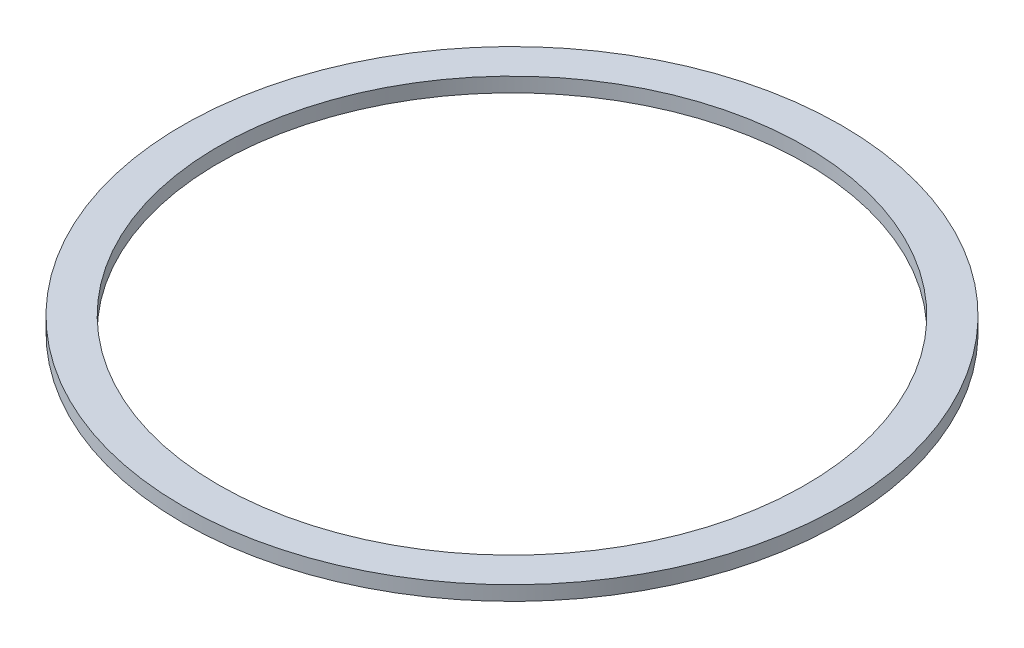
ISO-10303-21;
HEADER;
FILE_DESCRIPTION(('STEP AP214'),'2;1');
FILE_NAME('part.step','',(''),(''),'','','');
FILE_SCHEMA(('AUTOMOTIVE_DESIGN { 1 0 10303 214 1 1 1 1 }'));
ENDSEC;
DATA;
#1=APPLICATION_CONTEXT('core data for automotive mechanical design processes');
#2=APPLICATION_PROTOCOL_DEFINITION('international standard','automotive_design',2000,#1);
#3=PRODUCT_CONTEXT('',#1,'mechanical');
#4=PRODUCT('Part','Part','',(#3));
#5=PRODUCT_RELATED_PRODUCT_CATEGORY('part','',(#4));
#6=PRODUCT_DEFINITION_FORMATION('','',#4);
#7=PRODUCT_DEFINITION_CONTEXT('part definition',#1,'design');
#8=PRODUCT_DEFINITION('design','',#6,#7);
#9=PRODUCT_DEFINITION_SHAPE('','',#8);
#10=(LENGTH_UNIT() NAMED_UNIT(*) SI_UNIT(.MILLI.,.METRE.));
#11=(NAMED_UNIT(*) PLANE_ANGLE_UNIT() SI_UNIT($,.RADIAN.));
#12=(NAMED_UNIT(*) SI_UNIT($,.STERADIAN.) SOLID_ANGLE_UNIT());
#13=UNCERTAINTY_MEASURE_WITH_UNIT(LENGTH_MEASURE(1.E-05),#10,'distance_accuracy_value','');
#14=(GEOMETRIC_REPRESENTATION_CONTEXT(3) GLOBAL_UNCERTAINTY_ASSIGNED_CONTEXT((#13)) GLOBAL_UNIT_ASSIGNED_CONTEXT((#10,
#11,#12)) REPRESENTATION_CONTEXT('',''));
#15=CARTESIAN_POINT('',(0.,0.,0.));
#16=DIRECTION('',(0.,0.,1.));
#17=DIRECTION('',(1.,0.,0.));
#18=AXIS2_PLACEMENT_3D('',#15,#16,#17);
#19=CARTESIAN_POINT('',(0.,1.27,0.));
#20=DIRECTION('',(0.,1.,0.));
#21=DIRECTION('',(0.,0.,1.));
#22=AXIS2_PLACEMENT_3D('',#19,#20,#21);
#23=PLANE('',#22);
#24=CARTESIAN_POINT('',(0.,1.27,0.));
#25=DIRECTION('',(0.,1.,0.));
#26=DIRECTION('',(0.,0.,1.));
#27=AXIS2_PLACEMENT_3D('',#24,#25,#26);
#28=CIRCLE('',#27,28.8925);
#29=CARTESIAN_POINT('',(0.,1.27,28.8925));
#30=VERTEX_POINT('',#29);
#31=EDGE_CURVE('E10',#30,#30,#28,.T.);
#32=ORIENTED_EDGE('',*,*,#31,.T.);
#33=EDGE_LOOP('',(#32));
#34=FACE_BOUND('',#33,.T.);
#35=CARTESIAN_POINT('',(0.,1.27,0.));
#36=DIRECTION('',(0.,1.,0.));
#37=DIRECTION('',(0.,0.,1.));
#38=AXIS2_PLACEMENT_3D('',#35,#36,#37);
#39=CIRCLE('',#38,25.7175);
#40=CARTESIAN_POINT('',(0.,1.27,25.7175));
#41=VERTEX_POINT('',#40);
#42=EDGE_CURVE('E52',#41,#41,#39,.T.);
#43=ORIENTED_EDGE('',*,*,#42,.F.);
#44=EDGE_LOOP('',(#43));
#45=FACE_BOUND('',#44,.T.);
#46=ADVANCED_FACE('F41',(#34,#45),#23,.T.);
#47=CARTESIAN_POINT('',(0.,0.,0.));
#48=DIRECTION('',(0.,1.,0.));
#49=DIRECTION('',(0.,0.,1.));
#50=AXIS2_PLACEMENT_3D('',#47,#48,#49);
#51=PLANE('',#50);
#52=CARTESIAN_POINT('',(0.,0.,0.));
#53=DIRECTION('',(0.,1.,0.));
#54=DIRECTION('',(0.,0.,1.));
#55=AXIS2_PLACEMENT_3D('',#52,#53,#54);
#56=CIRCLE('',#55,28.8925);
#57=CARTESIAN_POINT('',(0.,0.,28.8925));
#58=VERTEX_POINT('',#57);
#59=EDGE_CURVE('E45',#58,#58,#56,.T.);
#60=ORIENTED_EDGE('',*,*,#59,.F.);
#61=EDGE_LOOP('',(#60));
#62=FACE_BOUND('',#61,.T.);
#63=CARTESIAN_POINT('',(0.,0.,0.));
#64=DIRECTION('',(0.,1.,0.));
#65=DIRECTION('',(0.,0.,1.));
#66=AXIS2_PLACEMENT_3D('',#63,#64,#65);
#67=CIRCLE('',#66,25.7175);
#68=CARTESIAN_POINT('',(0.,0.,25.7175));
#69=VERTEX_POINT('',#68);
#70=EDGE_CURVE('E54',#69,#69,#67,.T.);
#71=ORIENTED_EDGE('',*,*,#70,.T.);
#72=EDGE_LOOP('',(#71));
#73=FACE_BOUND('',#72,.T.);
#74=ADVANCED_FACE('F64',(#62,#73),#51,.F.);
#75=CARTESIAN_POINT('',(0.,1.27,0.));
#76=DIRECTION('',(0.,-1.,0.));
#77=DIRECTION('',(0.,0.,-1.));
#78=AXIS2_PLACEMENT_3D('',#75,#76,#77);
#79=CYLINDRICAL_SURFACE('',#78,28.8925);
#80=ORIENTED_EDGE('',*,*,#31,.F.);
#81=EDGE_LOOP('',(#80));
#82=FACE_BOUND('',#81,.T.);
#83=ORIENTED_EDGE('',*,*,#59,.T.);
#84=EDGE_LOOP('',(#83));
#85=FACE_BOUND('',#84,.T.);
#86=ADVANCED_FACE('F43',(#82,#85),#79,.T.);
#87=CARTESIAN_POINT('',(0.,1.27,0.));
#88=DIRECTION('',(0.,-1.,0.));
#89=DIRECTION('',(0.,0.,-1.));
#90=AXIS2_PLACEMENT_3D('',#87,#88,#89);
#91=CYLINDRICAL_SURFACE('',#90,25.7175);
#92=ORIENTED_EDGE('',*,*,#42,.T.);
#93=EDGE_LOOP('',(#92));
#94=FACE_BOUND('',#93,.T.);
#95=ORIENTED_EDGE('',*,*,#70,.F.);
#96=EDGE_LOOP('',(#95));
#97=FACE_BOUND('',#96,.T.);
#98=ADVANCED_FACE('F60',(#94,#97),#91,.F.);
#99=CLOSED_SHELL('',(#46,#74,#86,#98));
#100=MANIFOLD_SOLID_BREP('B2',#99);
#101=ADVANCED_BREP_SHAPE_REPRESENTATION('',(#18,#100),#14);
#102=SHAPE_DEFINITION_REPRESENTATION(#9,#101);
ENDSEC;
END-ISO-10303-21;
